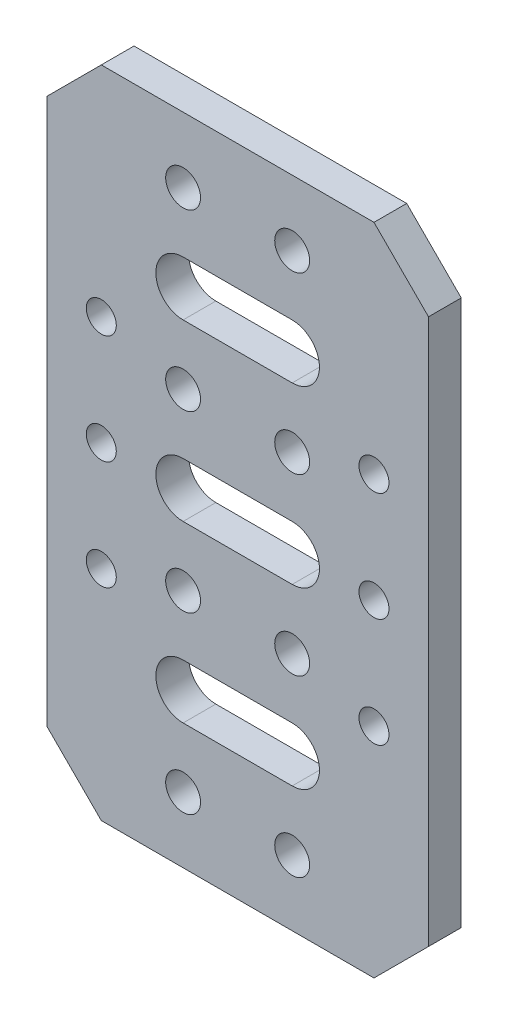
ISO-10303-21;
HEADER;
FILE_DESCRIPTION(('STEP AP214'),'2;1');
FILE_NAME('part.step','',(''),(''),'','','');
FILE_SCHEMA(('AUTOMOTIVE_DESIGN { 1 0 10303 214 1 1 1 1 }'));
ENDSEC;
DATA;
#1=APPLICATION_CONTEXT('core data for automotive mechanical design processes');
#2=APPLICATION_PROTOCOL_DEFINITION('international standard','automotive_design',2000,#1);
#3=PRODUCT_CONTEXT('',#1,'mechanical');
#4=PRODUCT('Part','Part','',(#3));
#5=PRODUCT_RELATED_PRODUCT_CATEGORY('part','',(#4));
#6=PRODUCT_DEFINITION_FORMATION('','',#4);
#7=PRODUCT_DEFINITION_CONTEXT('part definition',#1,'design');
#8=PRODUCT_DEFINITION('design','',#6,#7);
#9=PRODUCT_DEFINITION_SHAPE('','',#8);
#10=(LENGTH_UNIT() NAMED_UNIT(*) SI_UNIT(.MILLI.,.METRE.));
#11=(NAMED_UNIT(*) PLANE_ANGLE_UNIT() SI_UNIT($,.RADIAN.));
#12=(NAMED_UNIT(*) SI_UNIT($,.STERADIAN.) SOLID_ANGLE_UNIT());
#13=UNCERTAINTY_MEASURE_WITH_UNIT(LENGTH_MEASURE(1.E-05),#10,'distance_accuracy_value','');
#14=(GEOMETRIC_REPRESENTATION_CONTEXT(3) GLOBAL_UNCERTAINTY_ASSIGNED_CONTEXT((#13)) GLOBAL_UNIT_ASSIGNED_CONTEXT((#10,
#11,#12)) REPRESENTATION_CONTEXT('',''));
#15=CARTESIAN_POINT('',(0.,0.,0.));
#16=DIRECTION('',(0.,0.,1.));
#17=DIRECTION('',(1.,0.,0.));
#18=AXIS2_PLACEMENT_3D('',#15,#16,#17);
#19=CARTESIAN_POINT('',(0.,0.,3.));
#20=DIRECTION('',(0.,0.,1.));
#21=DIRECTION('',(1.,0.,0.));
#22=AXIS2_PLACEMENT_3D('',#19,#20,#21);
#23=PLANE('',#22);
#24=DIRECTION('',(1.,0.,0.));
#25=VECTOR('',#24,1.);
#26=CARTESIAN_POINT('',(0.,-18.5,3.));
#27=LINE('',#26,#25);
#28=CARTESIAN_POINT('',(-4.99999999999983,-18.5,3.));
#29=VERTEX_POINT('',#28);
#30=CARTESIAN_POINT('',(5.00000000000017,-18.5,3.));
#31=VERTEX_POINT('',#30);
#32=EDGE_CURVE('E54',#29,#31,#27,.T.);
#33=ORIENTED_EDGE('',*,*,#32,.F.);
#34=CARTESIAN_POINT('',(-4.99999999999983,-16.,3.));
#35=DIRECTION('',(0.,0.,1.));
#36=DIRECTION('',(1.,0.,0.));
#37=AXIS2_PLACEMENT_3D('',#34,#35,#36);
#38=CIRCLE('',#37,2.5);
#39=CARTESIAN_POINT('',(-4.99999999999983,-13.5,3.));
#40=VERTEX_POINT('',#39);
#41=EDGE_CURVE('E185',#40,#29,#38,.T.);
#42=ORIENTED_EDGE('',*,*,#41,.F.);
#43=DIRECTION('',(1.,0.,0.));
#44=VECTOR('',#43,1.);
#45=CARTESIAN_POINT('',(0.,-13.5,3.));
#46=LINE('',#45,#44);
#47=CARTESIAN_POINT('',(5.00000000000017,-13.5,3.));
#48=VERTEX_POINT('',#47);
#49=EDGE_CURVE('E212',#40,#48,#46,.T.);
#50=ORIENTED_EDGE('',*,*,#49,.T.);
#51=CARTESIAN_POINT('',(5.00000000000017,-16.,3.));
#52=DIRECTION('',(0.,0.,1.));
#53=DIRECTION('',(1.,0.,0.));
#54=AXIS2_PLACEMENT_3D('',#51,#52,#53);
#55=CIRCLE('',#54,2.5);
#56=EDGE_CURVE('E204',#31,#48,#55,.T.);
#57=ORIENTED_EDGE('',*,*,#56,.F.);
#58=EDGE_LOOP('',(#33,#42,#50,#57));
#59=FACE_BOUND('',#58,.T.);
#60=DIRECTION('',(1.,0.,0.));
#61=VECTOR('',#60,1.);
#62=CARTESIAN_POINT('',(0.,13.5,3.));
#63=LINE('',#62,#61);
#64=CARTESIAN_POINT('',(-5.00000000000006,13.5,3.));
#65=VERTEX_POINT('',#64);
#66=CARTESIAN_POINT('',(4.99999999999995,13.5,3.));
#67=VERTEX_POINT('',#66);
#68=EDGE_CURVE('E236',#65,#67,#63,.T.);
#69=ORIENTED_EDGE('',*,*,#68,.F.);
#70=CARTESIAN_POINT('',(-5.00000000000006,16.,3.));
#71=DIRECTION('',(0.,0.,1.));
#72=DIRECTION('',(1.,0.,0.));
#73=AXIS2_PLACEMENT_3D('',#70,#71,#72);
#74=CIRCLE('',#73,2.5);
#75=CARTESIAN_POINT('',(-5.00000000000006,18.5,3.));
#76=VERTEX_POINT('',#75);
#77=EDGE_CURVE('E247',#76,#65,#74,.T.);
#78=ORIENTED_EDGE('',*,*,#77,.F.);
#79=DIRECTION('',(1.,0.,0.));
#80=VECTOR('',#79,1.);
#81=CARTESIAN_POINT('',(0.,18.5,3.));
#82=LINE('',#81,#80);
#83=CARTESIAN_POINT('',(4.99999999999994,18.5,3.));
#84=VERTEX_POINT('',#83);
#85=EDGE_CURVE('E243',#76,#84,#82,.T.);
#86=ORIENTED_EDGE('',*,*,#85,.T.);
#87=CARTESIAN_POINT('',(4.99999999999994,16.,3.));
#88=DIRECTION('',(0.,0.,1.));
#89=DIRECTION('',(1.,0.,0.));
#90=AXIS2_PLACEMENT_3D('',#87,#88,#89);
#91=CIRCLE('',#90,2.5);
#92=EDGE_CURVE('E239',#67,#84,#91,.T.);
#93=ORIENTED_EDGE('',*,*,#92,.F.);
#94=EDGE_LOOP('',(#69,#78,#86,#93));
#95=FACE_BOUND('',#94,.T.);
#96=DIRECTION('',(1.,0.,0.));
#97=VECTOR('',#96,1.);
#98=CARTESIAN_POINT('',(0.,-2.5,3.));
#99=LINE('',#98,#97);
#100=CARTESIAN_POINT('',(-5.,-2.5,3.));
#101=VERTEX_POINT('',#100);
#102=CARTESIAN_POINT('',(5.,-2.5,3.));
#103=VERTEX_POINT('',#102);
#104=EDGE_CURVE('E280',#101,#103,#99,.T.);
#105=ORIENTED_EDGE('',*,*,#104,.F.);
#106=CARTESIAN_POINT('',(-5.,0.,3.));
#107=DIRECTION('',(0.,0.,1.));
#108=DIRECTION('',(1.,0.,0.));
#109=AXIS2_PLACEMENT_3D('',#106,#107,#108);
#110=CIRCLE('',#109,2.5);
#111=CARTESIAN_POINT('',(-5.,2.5,3.));
#112=VERTEX_POINT('',#111);
#113=EDGE_CURVE('E291',#112,#101,#110,.T.);
#114=ORIENTED_EDGE('',*,*,#113,.F.);
#115=DIRECTION('',(1.,0.,0.));
#116=VECTOR('',#115,1.);
#117=CARTESIAN_POINT('',(0.,2.5,3.));
#118=LINE('',#117,#116);
#119=CARTESIAN_POINT('',(5.,2.5,3.));
#120=VERTEX_POINT('',#119);
#121=EDGE_CURVE('E287',#112,#120,#118,.T.);
#122=ORIENTED_EDGE('',*,*,#121,.T.);
#123=CARTESIAN_POINT('',(5.,0.,3.));
#124=DIRECTION('',(0.,0.,1.));
#125=DIRECTION('',(1.,0.,0.));
#126=AXIS2_PLACEMENT_3D('',#123,#124,#125);
#127=CIRCLE('',#126,2.5);
#128=EDGE_CURVE('E283',#103,#120,#127,.T.);
#129=ORIENTED_EDGE('',*,*,#128,.F.);
#130=EDGE_LOOP('',(#105,#114,#122,#129));
#131=FACE_BOUND('',#130,.T.);
#132=CARTESIAN_POINT('',(-12.4999999999999,-10.,3.));
#133=DIRECTION('',(0.,0.,1.));
#134=DIRECTION('',(-1.,0.,0.));
#135=AXIS2_PLACEMENT_3D('',#132,#133,#134);
#136=CIRCLE('',#135,1.375);
#137=CARTESIAN_POINT('',(-13.8749999999999,-10.,3.));
#138=VERTEX_POINT('',#137);
#139=EDGE_CURVE('E312',#138,#138,#136,.T.);
#140=ORIENTED_EDGE('',*,*,#139,.F.);
#141=EDGE_LOOP('',(#140));
#142=FACE_BOUND('',#141,.T.);
#143=CARTESIAN_POINT('',(12.5000000000001,-10.,3.));
#144=DIRECTION('',(0.,0.,1.));
#145=DIRECTION('',(1.,0.,0.));
#146=AXIS2_PLACEMENT_3D('',#143,#144,#145);
#147=CIRCLE('',#146,1.375);
#148=CARTESIAN_POINT('',(13.8750000000001,-10.,3.));
#149=VERTEX_POINT('',#148);
#150=EDGE_CURVE('E320',#149,#149,#147,.T.);
#151=ORIENTED_EDGE('',*,*,#150,.F.);
#152=EDGE_LOOP('',(#151));
#153=FACE_BOUND('',#152,.T.);
#154=CARTESIAN_POINT('',(-12.5,10.,3.));
#155=DIRECTION('',(0.,0.,1.));
#156=DIRECTION('',(-1.,0.,0.));
#157=AXIS2_PLACEMENT_3D('',#154,#155,#156);
#158=CIRCLE('',#157,1.375);
#159=CARTESIAN_POINT('',(-13.875,10.,3.));
#160=VERTEX_POINT('',#159);
#161=EDGE_CURVE('E328',#160,#160,#158,.T.);
#162=ORIENTED_EDGE('',*,*,#161,.F.);
#163=EDGE_LOOP('',(#162));
#164=FACE_BOUND('',#163,.T.);
#165=CARTESIAN_POINT('',(12.5,10.,3.));
#166=DIRECTION('',(0.,0.,1.));
#167=DIRECTION('',(1.,0.,0.));
#168=AXIS2_PLACEMENT_3D('',#165,#166,#167);
#169=CIRCLE('',#168,1.375);
#170=CARTESIAN_POINT('',(13.875,10.,3.));
#171=VERTEX_POINT('',#170);
#172=EDGE_CURVE('E336',#171,#171,#169,.T.);
#173=ORIENTED_EDGE('',*,*,#172,.F.);
#174=EDGE_LOOP('',(#173));
#175=FACE_BOUND('',#174,.T.);
#176=CARTESIAN_POINT('',(-12.5,0.,3.));
#177=DIRECTION('',(0.,0.,1.));
#178=DIRECTION('',(-1.,0.,0.));
#179=AXIS2_PLACEMENT_3D('',#176,#177,#178);
#180=CIRCLE('',#179,1.375);
#181=CARTESIAN_POINT('',(-13.875,0.,3.));
#182=VERTEX_POINT('',#181);
#183=EDGE_CURVE('E344',#182,#182,#180,.T.);
#184=ORIENTED_EDGE('',*,*,#183,.F.);
#185=EDGE_LOOP('',(#184));
#186=FACE_BOUND('',#185,.T.);
#187=CARTESIAN_POINT('',(12.5,0.,3.));
#188=DIRECTION('',(0.,0.,1.));
#189=DIRECTION('',(1.,0.,0.));
#190=AXIS2_PLACEMENT_3D('',#187,#188,#189);
#191=CIRCLE('',#190,1.375);
#192=CARTESIAN_POINT('',(13.875,0.,3.));
#193=VERTEX_POINT('',#192);
#194=EDGE_CURVE('E352',#193,#193,#191,.T.);
#195=ORIENTED_EDGE('',*,*,#194,.F.);
#196=EDGE_LOOP('',(#195));
#197=FACE_BOUND('',#196,.T.);
#198=CARTESIAN_POINT('',(-4.99999999999966,-24.,3.));
#199=DIRECTION('',(0.,0.,1.));
#200=DIRECTION('',(1.,0.,0.));
#201=AXIS2_PLACEMENT_3D('',#198,#199,#200);
#202=CIRCLE('',#201,1.6);
#203=CARTESIAN_POINT('',(-3.39999999999965,-24.,3.));
#204=VERTEX_POINT('',#203);
#205=EDGE_CURVE('E369',#204,#204,#202,.T.);
#206=ORIENTED_EDGE('',*,*,#205,.F.);
#207=EDGE_LOOP('',(#206));
#208=FACE_BOUND('',#207,.T.);
#209=CARTESIAN_POINT('',(-4.99999999999982,-8.00000000000001,3.));
#210=DIRECTION('',(0.,0.,1.));
#211=DIRECTION('',(1.,0.,0.));
#212=AXIS2_PLACEMENT_3D('',#209,#210,#211);
#213=CIRCLE('',#212,1.6);
#214=CARTESIAN_POINT('',(-3.39999999999982,-8.00000000000001,3.));
#215=VERTEX_POINT('',#214);
#216=EDGE_CURVE('E385',#215,#215,#213,.T.);
#217=ORIENTED_EDGE('',*,*,#216,.F.);
#218=EDGE_LOOP('',(#217));
#219=FACE_BOUND('',#218,.T.);
#220=CARTESIAN_POINT('',(-5.00000000000005,24.,3.));
#221=DIRECTION('',(0.,0.,1.));
#222=DIRECTION('',(1.,0.,0.));
#223=AXIS2_PLACEMENT_3D('',#220,#221,#222);
#224=CIRCLE('',#223,1.6);
#225=CARTESIAN_POINT('',(-3.40000000000005,24.,3.));
#226=VERTEX_POINT('',#225);
#227=EDGE_CURVE('E401',#226,#226,#224,.T.);
#228=ORIENTED_EDGE('',*,*,#227,.F.);
#229=EDGE_LOOP('',(#228));
#230=FACE_BOUND('',#229,.T.);
#231=CARTESIAN_POINT('',(-5.,8.,3.));
#232=DIRECTION('',(0.,0.,1.));
#233=DIRECTION('',(1.,0.,0.));
#234=AXIS2_PLACEMENT_3D('',#231,#232,#233);
#235=CIRCLE('',#234,1.6);
#236=CARTESIAN_POINT('',(-3.39999999999999,8.,3.));
#237=VERTEX_POINT('',#236);
#238=EDGE_CURVE('E417',#237,#237,#235,.T.);
#239=ORIENTED_EDGE('',*,*,#238,.F.);
#240=EDGE_LOOP('',(#239));
#241=FACE_BOUND('',#240,.T.);
#242=DIRECTION('',(1.,0.,0.));
#243=VECTOR('',#242,1.);
#244=CARTESIAN_POINT('',(-17.5,-30.,3.));
#245=LINE('',#244,#243);
#246=CARTESIAN_POINT('',(-12.5,-30.,3.));
#247=VERTEX_POINT('',#246);
#248=CARTESIAN_POINT('',(12.5,-30.,3.));
#249=VERTEX_POINT('',#248);
#250=EDGE_CURVE('E438',#247,#249,#245,.T.);
#251=ORIENTED_EDGE('',*,*,#250,.T.);
#252=DIRECTION('',(-0.707106781186549,-0.707106781186546,0.));
#253=VECTOR('',#252,1.);
#254=CARTESIAN_POINT('',(21.25,-21.25,3.));
#255=LINE('',#254,#253);
#256=CARTESIAN_POINT('',(17.5,-25.,3.));
#257=VERTEX_POINT('',#256);
#258=EDGE_CURVE('E490',#249,#257,#255,.F.);
#259=ORIENTED_EDGE('',*,*,#258,.T.);
#260=DIRECTION('',(0.,1.,0.));
#261=VECTOR('',#260,1.);
#262=CARTESIAN_POINT('',(17.5,30.,3.));
#263=LINE('',#262,#261);
#264=CARTESIAN_POINT('',(17.5,25.,3.));
#265=VERTEX_POINT('',#264);
#266=EDGE_CURVE('E425',#257,#265,#263,.T.);
#267=ORIENTED_EDGE('',*,*,#266,.T.);
#268=DIRECTION('',(0.707106781186546,-0.707106781186549,0.));
#269=VECTOR('',#268,1.);
#270=CARTESIAN_POINT('',(21.25,21.2499999999999,3.));
#271=LINE('',#270,#269);
#272=CARTESIAN_POINT('',(12.5,30.,3.));
#273=VERTEX_POINT('',#272);
#274=EDGE_CURVE('E485',#265,#273,#271,.F.);
#275=ORIENTED_EDGE('',*,*,#274,.T.);
#276=DIRECTION('',(-1.,0.,0.));
#277=VECTOR('',#276,1.);
#278=CARTESIAN_POINT('',(-17.5,30.,3.));
#279=LINE('',#278,#277);
#280=CARTESIAN_POINT('',(-12.5,30.,3.));
#281=VERTEX_POINT('',#280);
#282=EDGE_CURVE('E429',#273,#281,#279,.T.);
#283=ORIENTED_EDGE('',*,*,#282,.T.);
#284=DIRECTION('',(0.707106781186549,0.707106781186547,0.));
#285=VECTOR('',#284,1.);
#286=CARTESIAN_POINT('',(-21.25,21.25,3.));
#287=LINE('',#286,#285);
#288=CARTESIAN_POINT('',(-17.5,25.,3.));
#289=VERTEX_POINT('',#288);
#290=EDGE_CURVE('E482',#281,#289,#287,.F.);
#291=ORIENTED_EDGE('',*,*,#290,.T.);
#292=DIRECTION('',(0.,-1.,0.));
#293=VECTOR('',#292,1.);
#294=CARTESIAN_POINT('',(-17.5,30.,3.));
#295=LINE('',#294,#293);
#296=CARTESIAN_POINT('',(-17.5,-25.,3.));
#297=VERTEX_POINT('',#296);
#298=EDGE_CURVE('E434',#289,#297,#295,.T.);
#299=ORIENTED_EDGE('',*,*,#298,.T.);
#300=DIRECTION('',(-0.707106781186546,0.707106781186549,0.));
#301=VECTOR('',#300,1.);
#302=CARTESIAN_POINT('',(-21.25,-21.2499999999999,3.));
#303=LINE('',#302,#301);
#304=EDGE_CURVE('E488',#297,#247,#303,.F.);
#305=ORIENTED_EDGE('',*,*,#304,.T.);
#306=EDGE_LOOP('',(#251,#259,#267,#275,#283,#291,#299,#305));
#307=FACE_BOUND('',#306,.T.);
#308=CARTESIAN_POINT('',(5.00000000000001,7.99999999999999,3.));
#309=DIRECTION('',(0.,0.,1.));
#310=DIRECTION('',(-1.,0.,0.));
#311=AXIS2_PLACEMENT_3D('',#308,#309,#310);
#312=CIRCLE('',#311,1.6);
#313=CARTESIAN_POINT('',(3.40000000000001,7.99999999999999,3.));
#314=VERTEX_POINT('',#313);
#315=EDGE_CURVE('E409',#314,#314,#312,.T.);
#316=ORIENTED_EDGE('',*,*,#315,.F.);
#317=EDGE_LOOP('',(#316));
#318=FACE_BOUND('',#317,.T.);
#319=CARTESIAN_POINT('',(4.99999999999996,24.,3.));
#320=DIRECTION('',(0.,0.,1.));
#321=DIRECTION('',(-1.,0.,0.));
#322=AXIS2_PLACEMENT_3D('',#319,#320,#321);
#323=CIRCLE('',#322,1.6);
#324=CARTESIAN_POINT('',(3.39999999999996,24.,3.));
#325=VERTEX_POINT('',#324);
#326=EDGE_CURVE('E393',#325,#325,#323,.T.);
#327=ORIENTED_EDGE('',*,*,#326,.F.);
#328=EDGE_LOOP('',(#327));
#329=FACE_BOUND('',#328,.T.);
#330=CARTESIAN_POINT('',(5.00000000000018,-8.00000000000001,3.));
#331=DIRECTION('',(0.,0.,1.));
#332=DIRECTION('',(-1.,0.,0.));
#333=AXIS2_PLACEMENT_3D('',#330,#331,#332);
#334=CIRCLE('',#333,1.6);
#335=CARTESIAN_POINT('',(3.40000000000018,-8.00000000000001,3.));
#336=VERTEX_POINT('',#335);
#337=EDGE_CURVE('E377',#336,#336,#334,.T.);
#338=ORIENTED_EDGE('',*,*,#337,.F.);
#339=EDGE_LOOP('',(#338));
#340=FACE_BOUND('',#339,.T.);
#341=CARTESIAN_POINT('',(5.00000000000035,-24.,3.));
#342=DIRECTION('',(0.,0.,1.));
#343=DIRECTION('',(-1.,0.,0.));
#344=AXIS2_PLACEMENT_3D('',#341,#342,#343);
#345=CIRCLE('',#344,1.6);
#346=CARTESIAN_POINT('',(3.40000000000035,-24.,3.));
#347=VERTEX_POINT('',#346);
#348=EDGE_CURVE('E361',#347,#347,#345,.T.);
#349=ORIENTED_EDGE('',*,*,#348,.F.);
#350=EDGE_LOOP('',(#349));
#351=FACE_BOUND('',#350,.T.);
#352=ADVANCED_FACE('F38',(#59,#95,#131,#142,#153,#164,#175,#186,#197,#208,#219,#230,#241,#307,
#318,#329,#340,#351),#23,.T.);
#353=CARTESIAN_POINT('',(0.,0.,0.));
#354=DIRECTION('',(0.,0.,1.));
#355=DIRECTION('',(1.,0.,0.));
#356=AXIS2_PLACEMENT_3D('',#353,#354,#355);
#357=PLANE('',#356);
#358=CARTESIAN_POINT('',(-4.99999999999983,-16.,0.));
#359=DIRECTION('',(0.,0.,1.));
#360=DIRECTION('',(1.,0.,0.));
#361=AXIS2_PLACEMENT_3D('',#358,#359,#360);
#362=CIRCLE('',#361,2.5);
#363=CARTESIAN_POINT('',(-4.99999999999983,-18.5,0.));
#364=VERTEX_POINT('',#363);
#365=CARTESIAN_POINT('',(-4.99999999999983,-13.5,0.));
#366=VERTEX_POINT('',#365);
#367=EDGE_CURVE('E198',#364,#366,#362,.F.);
#368=ORIENTED_EDGE('',*,*,#367,.F.);
#369=DIRECTION('',(-1.,0.,0.));
#370=VECTOR('',#369,1.);
#371=CARTESIAN_POINT('',(0.,-18.5,0.));
#372=LINE('',#371,#370);
#373=CARTESIAN_POINT('',(5.00000000000017,-18.5,0.));
#374=VERTEX_POINT('',#373);
#375=EDGE_CURVE('E178',#374,#364,#372,.T.);
#376=ORIENTED_EDGE('',*,*,#375,.F.);
#377=CARTESIAN_POINT('',(5.00000000000017,-16.,0.));
#378=DIRECTION('',(0.,0.,1.));
#379=DIRECTION('',(1.,0.,0.));
#380=AXIS2_PLACEMENT_3D('',#377,#378,#379);
#381=CIRCLE('',#380,2.5);
#382=CARTESIAN_POINT('',(5.00000000000017,-13.5,0.));
#383=VERTEX_POINT('',#382);
#384=EDGE_CURVE('E188',#383,#374,#381,.F.);
#385=ORIENTED_EDGE('',*,*,#384,.F.);
#386=DIRECTION('',(-1.,0.,0.));
#387=VECTOR('',#386,1.);
#388=CARTESIAN_POINT('',(0.,-13.5,0.));
#389=LINE('',#388,#387);
#390=EDGE_CURVE('E62',#383,#366,#389,.T.);
#391=ORIENTED_EDGE('',*,*,#390,.T.);
#392=EDGE_LOOP('',(#368,#376,#385,#391));
#393=FACE_BOUND('',#392,.T.);
#394=CARTESIAN_POINT('',(-5.00000000000006,16.,0.));
#395=DIRECTION('',(0.,0.,1.));
#396=DIRECTION('',(1.,0.,0.));
#397=AXIS2_PLACEMENT_3D('',#394,#395,#396);
#398=CIRCLE('',#397,2.5);
#399=CARTESIAN_POINT('',(-5.00000000000006,13.5,0.));
#400=VERTEX_POINT('',#399);
#401=CARTESIAN_POINT('',(-5.00000000000006,18.5,0.));
#402=VERTEX_POINT('',#401);
#403=EDGE_CURVE('E228',#400,#402,#398,.F.);
#404=ORIENTED_EDGE('',*,*,#403,.F.);
#405=DIRECTION('',(-1.,0.,0.));
#406=VECTOR('',#405,1.);
#407=CARTESIAN_POINT('',(0.,13.5,0.));
#408=LINE('',#407,#406);
#409=CARTESIAN_POINT('',(4.99999999999995,13.5,0.));
#410=VERTEX_POINT('',#409);
#411=EDGE_CURVE('E232',#410,#400,#408,.T.);
#412=ORIENTED_EDGE('',*,*,#411,.F.);
#413=CARTESIAN_POINT('',(4.99999999999994,16.,0.));
#414=DIRECTION('',(0.,0.,1.));
#415=DIRECTION('',(1.,0.,0.));
#416=AXIS2_PLACEMENT_3D('',#413,#414,#415);
#417=CIRCLE('',#416,2.5);
#418=CARTESIAN_POINT('',(4.99999999999994,18.5,0.));
#419=VERTEX_POINT('',#418);
#420=EDGE_CURVE('E255',#419,#410,#417,.F.);
#421=ORIENTED_EDGE('',*,*,#420,.F.);
#422=DIRECTION('',(-1.,0.,0.));
#423=VECTOR('',#422,1.);
#424=CARTESIAN_POINT('',(0.,18.5,0.));
#425=LINE('',#424,#423);
#426=EDGE_CURVE('E192',#419,#402,#425,.T.);
#427=ORIENTED_EDGE('',*,*,#426,.T.);
#428=EDGE_LOOP('',(#404,#412,#421,#427));
#429=FACE_BOUND('',#428,.T.);
#430=CARTESIAN_POINT('',(-5.,0.,0.));
#431=DIRECTION('',(0.,0.,1.));
#432=DIRECTION('',(1.,0.,0.));
#433=AXIS2_PLACEMENT_3D('',#430,#431,#432);
#434=CIRCLE('',#433,2.5);
#435=CARTESIAN_POINT('',(-5.,-2.5,0.));
#436=VERTEX_POINT('',#435);
#437=CARTESIAN_POINT('',(-5.,2.5,0.));
#438=VERTEX_POINT('',#437);
#439=EDGE_CURVE('E272',#436,#438,#434,.F.);
#440=ORIENTED_EDGE('',*,*,#439,.F.);
#441=DIRECTION('',(-1.,0.,0.));
#442=VECTOR('',#441,1.);
#443=CARTESIAN_POINT('',(0.,-2.5,0.));
#444=LINE('',#443,#442);
#445=CARTESIAN_POINT('',(5.,-2.5,0.));
#446=VERTEX_POINT('',#445);
#447=EDGE_CURVE('E276',#446,#436,#444,.T.);
#448=ORIENTED_EDGE('',*,*,#447,.F.);
#449=CARTESIAN_POINT('',(5.,0.,0.));
#450=DIRECTION('',(0.,0.,1.));
#451=DIRECTION('',(1.,0.,0.));
#452=AXIS2_PLACEMENT_3D('',#449,#450,#451);
#453=CIRCLE('',#452,2.5);
#454=CARTESIAN_POINT('',(5.,2.5,0.));
#455=VERTEX_POINT('',#454);
#456=EDGE_CURVE('E299',#455,#446,#453,.F.);
#457=ORIENTED_EDGE('',*,*,#456,.F.);
#458=DIRECTION('',(-1.,0.,0.));
#459=VECTOR('',#458,1.);
#460=CARTESIAN_POINT('',(0.,2.5,0.));
#461=LINE('',#460,#459);
#462=EDGE_CURVE('E268',#455,#438,#461,.T.);
#463=ORIENTED_EDGE('',*,*,#462,.T.);
#464=EDGE_LOOP('',(#440,#448,#457,#463));
#465=FACE_BOUND('',#464,.T.);
#466=CARTESIAN_POINT('',(-12.4999999999999,-10.,0.));
#467=DIRECTION('',(0.,0.,1.));
#468=DIRECTION('',(1.,0.,0.));
#469=AXIS2_PLACEMENT_3D('',#466,#467,#468);
#470=CIRCLE('',#469,1.375);
#471=CARTESIAN_POINT('',(-11.1249999999999,-10.,0.));
#472=VERTEX_POINT('',#471);
#473=EDGE_CURVE('E316',#472,#472,#470,.F.);
#474=ORIENTED_EDGE('',*,*,#473,.F.);
#475=EDGE_LOOP('',(#474));
#476=FACE_BOUND('',#475,.T.);
#477=CARTESIAN_POINT('',(12.5000000000001,-10.,0.));
#478=DIRECTION('',(0.,0.,1.));
#479=DIRECTION('',(1.,0.,0.));
#480=AXIS2_PLACEMENT_3D('',#477,#478,#479);
#481=CIRCLE('',#480,1.375);
#482=CARTESIAN_POINT('',(13.8750000000001,-10.,0.));
#483=VERTEX_POINT('',#482);
#484=EDGE_CURVE('E324',#483,#483,#481,.F.);
#485=ORIENTED_EDGE('',*,*,#484,.F.);
#486=EDGE_LOOP('',(#485));
#487=FACE_BOUND('',#486,.T.);
#488=CARTESIAN_POINT('',(-12.5,10.,0.));
#489=DIRECTION('',(0.,0.,1.));
#490=DIRECTION('',(1.,0.,0.));
#491=AXIS2_PLACEMENT_3D('',#488,#489,#490);
#492=CIRCLE('',#491,1.375);
#493=CARTESIAN_POINT('',(-11.125,10.,0.));
#494=VERTEX_POINT('',#493);
#495=EDGE_CURVE('E332',#494,#494,#492,.F.);
#496=ORIENTED_EDGE('',*,*,#495,.F.);
#497=EDGE_LOOP('',(#496));
#498=FACE_BOUND('',#497,.T.);
#499=CARTESIAN_POINT('',(12.5,10.,0.));
#500=DIRECTION('',(0.,0.,1.));
#501=DIRECTION('',(1.,0.,0.));
#502=AXIS2_PLACEMENT_3D('',#499,#500,#501);
#503=CIRCLE('',#502,1.375);
#504=CARTESIAN_POINT('',(13.875,10.,0.));
#505=VERTEX_POINT('',#504);
#506=EDGE_CURVE('E340',#505,#505,#503,.F.);
#507=ORIENTED_EDGE('',*,*,#506,.F.);
#508=EDGE_LOOP('',(#507));
#509=FACE_BOUND('',#508,.T.);
#510=CARTESIAN_POINT('',(-12.5,0.,0.));
#511=DIRECTION('',(0.,0.,1.));
#512=DIRECTION('',(1.,0.,0.));
#513=AXIS2_PLACEMENT_3D('',#510,#511,#512);
#514=CIRCLE('',#513,1.375);
#515=CARTESIAN_POINT('',(-11.125,0.,0.));
#516=VERTEX_POINT('',#515);
#517=EDGE_CURVE('E348',#516,#516,#514,.F.);
#518=ORIENTED_EDGE('',*,*,#517,.F.);
#519=EDGE_LOOP('',(#518));
#520=FACE_BOUND('',#519,.T.);
#521=CARTESIAN_POINT('',(12.5,0.,0.));
#522=DIRECTION('',(0.,0.,1.));
#523=DIRECTION('',(1.,0.,0.));
#524=AXIS2_PLACEMENT_3D('',#521,#522,#523);
#525=CIRCLE('',#524,1.375);
#526=CARTESIAN_POINT('',(13.875,0.,0.));
#527=VERTEX_POINT('',#526);
#528=EDGE_CURVE('E356',#527,#527,#525,.F.);
#529=ORIENTED_EDGE('',*,*,#528,.F.);
#530=EDGE_LOOP('',(#529));
#531=FACE_BOUND('',#530,.T.);
#532=CARTESIAN_POINT('',(-4.99999999999966,-24.,0.));
#533=DIRECTION('',(0.,0.,1.));
#534=DIRECTION('',(1.,0.,0.));
#535=AXIS2_PLACEMENT_3D('',#532,#533,#534);
#536=CIRCLE('',#535,1.6);
#537=CARTESIAN_POINT('',(-3.39999999999965,-24.,0.));
#538=VERTEX_POINT('',#537);
#539=EDGE_CURVE('E365',#538,#538,#536,.T.);
#540=ORIENTED_EDGE('',*,*,#539,.T.);
#541=EDGE_LOOP('',(#540));
#542=FACE_BOUND('',#541,.T.);
#543=CARTESIAN_POINT('',(-4.99999999999982,-8.00000000000001,0.));
#544=DIRECTION('',(0.,0.,1.));
#545=DIRECTION('',(1.,0.,0.));
#546=AXIS2_PLACEMENT_3D('',#543,#544,#545);
#547=CIRCLE('',#546,1.6);
#548=CARTESIAN_POINT('',(-3.39999999999982,-8.00000000000001,0.));
#549=VERTEX_POINT('',#548);
#550=EDGE_CURVE('E381',#549,#549,#547,.T.);
#551=ORIENTED_EDGE('',*,*,#550,.T.);
#552=EDGE_LOOP('',(#551));
#553=FACE_BOUND('',#552,.T.);
#554=CARTESIAN_POINT('',(-5.00000000000005,24.,0.));
#555=DIRECTION('',(0.,0.,1.));
#556=DIRECTION('',(1.,0.,0.));
#557=AXIS2_PLACEMENT_3D('',#554,#555,#556);
#558=CIRCLE('',#557,1.6);
#559=CARTESIAN_POINT('',(-3.40000000000005,24.,0.));
#560=VERTEX_POINT('',#559);
#561=EDGE_CURVE('E397',#560,#560,#558,.T.);
#562=ORIENTED_EDGE('',*,*,#561,.T.);
#563=EDGE_LOOP('',(#562));
#564=FACE_BOUND('',#563,.T.);
#565=CARTESIAN_POINT('',(-5.,8.,0.));
#566=DIRECTION('',(0.,0.,1.));
#567=DIRECTION('',(1.,0.,0.));
#568=AXIS2_PLACEMENT_3D('',#565,#566,#567);
#569=CIRCLE('',#568,1.6);
#570=CARTESIAN_POINT('',(-3.39999999999999,8.,0.));
#571=VERTEX_POINT('',#570);
#572=EDGE_CURVE('E413',#571,#571,#569,.T.);
#573=ORIENTED_EDGE('',*,*,#572,.T.);
#574=EDGE_LOOP('',(#573));
#575=FACE_BOUND('',#574,.T.);
#576=DIRECTION('',(0.,1.,0.));
#577=VECTOR('',#576,1.);
#578=CARTESIAN_POINT('',(17.5,30.,0.));
#579=LINE('',#578,#577);
#580=CARTESIAN_POINT('',(17.5,-25.,0.));
#581=VERTEX_POINT('',#580);
#582=CARTESIAN_POINT('',(17.5,25.,0.));
#583=VERTEX_POINT('',#582);
#584=EDGE_CURVE('E421',#581,#583,#579,.T.);
#585=ORIENTED_EDGE('',*,*,#584,.F.);
#586=DIRECTION('',(0.707106781186549,0.707106781186546,0.));
#587=VECTOR('',#586,1.);
#588=CARTESIAN_POINT('',(17.5,-25.,0.));
#589=LINE('',#588,#587);
#590=CARTESIAN_POINT('',(12.5,-30.,0.));
#591=VERTEX_POINT('',#590);
#592=EDGE_CURVE('E472',#581,#591,#589,.F.);
#593=ORIENTED_EDGE('',*,*,#592,.T.);
#594=DIRECTION('',(1.,0.,0.));
#595=VECTOR('',#594,1.);
#596=CARTESIAN_POINT('',(-17.5,-30.,0.));
#597=LINE('',#596,#595);
#598=CARTESIAN_POINT('',(-12.5,-30.,0.));
#599=VERTEX_POINT('',#598);
#600=EDGE_CURVE('E430',#599,#591,#597,.T.);
#601=ORIENTED_EDGE('',*,*,#600,.F.);
#602=DIRECTION('',(0.707106781186546,-0.707106781186549,0.));
#603=VECTOR('',#602,1.);
#604=CARTESIAN_POINT('',(-12.5,-30.,0.));
#605=LINE('',#604,#603);
#606=CARTESIAN_POINT('',(-17.5,-25.,0.));
#607=VERTEX_POINT('',#606);
#608=EDGE_CURVE('E469',#599,#607,#605,.F.);
#609=ORIENTED_EDGE('',*,*,#608,.T.);
#610=DIRECTION('',(0.,-1.,0.));
#611=VECTOR('',#610,1.);
#612=CARTESIAN_POINT('',(-17.5,30.,0.));
#613=LINE('',#612,#611);
#614=CARTESIAN_POINT('',(-17.5,25.,0.));
#615=VERTEX_POINT('',#614);
#616=EDGE_CURVE('E450',#615,#607,#613,.T.);
#617=ORIENTED_EDGE('',*,*,#616,.F.);
#618=DIRECTION('',(-0.707106781186549,-0.707106781186547,0.));
#619=VECTOR('',#618,1.);
#620=CARTESIAN_POINT('',(-17.5,25.,0.));
#621=LINE('',#620,#619);
#622=CARTESIAN_POINT('',(-12.5,30.,0.));
#623=VERTEX_POINT('',#622);
#624=EDGE_CURVE('E463',#615,#623,#621,.F.);
#625=ORIENTED_EDGE('',*,*,#624,.T.);
#626=DIRECTION('',(-1.,0.,0.));
#627=VECTOR('',#626,1.);
#628=CARTESIAN_POINT('',(-17.5,30.,0.));
#629=LINE('',#628,#627);
#630=CARTESIAN_POINT('',(12.5,30.,0.));
#631=VERTEX_POINT('',#630);
#632=EDGE_CURVE('E446',#631,#623,#629,.T.);
#633=ORIENTED_EDGE('',*,*,#632,.F.);
#634=DIRECTION('',(-0.707106781186546,0.707106781186549,0.));
#635=VECTOR('',#634,1.);
#636=CARTESIAN_POINT('',(12.5,30.,0.));
#637=LINE('',#636,#635);
#638=EDGE_CURVE('E466',#631,#583,#637,.F.);
#639=ORIENTED_EDGE('',*,*,#638,.T.);
#640=EDGE_LOOP('',(#585,#593,#601,#609,#617,#625,#633,#639));
#641=FACE_BOUND('',#640,.T.);
#642=CARTESIAN_POINT('',(5.00000000000001,7.99999999999999,0.));
#643=DIRECTION('',(0.,0.,1.));
#644=DIRECTION('',(-1.,0.,0.));
#645=AXIS2_PLACEMENT_3D('',#642,#643,#644);
#646=CIRCLE('',#645,1.6);
#647=CARTESIAN_POINT('',(3.40000000000001,7.99999999999999,0.));
#648=VERTEX_POINT('',#647);
#649=EDGE_CURVE('E405',#648,#648,#646,.T.);
#650=ORIENTED_EDGE('',*,*,#649,.T.);
#651=EDGE_LOOP('',(#650));
#652=FACE_BOUND('',#651,.T.);
#653=CARTESIAN_POINT('',(4.99999999999996,24.,0.));
#654=DIRECTION('',(0.,0.,1.));
#655=DIRECTION('',(-1.,0.,0.));
#656=AXIS2_PLACEMENT_3D('',#653,#654,#655);
#657=CIRCLE('',#656,1.6);
#658=CARTESIAN_POINT('',(3.39999999999996,24.,0.));
#659=VERTEX_POINT('',#658);
#660=EDGE_CURVE('E389',#659,#659,#657,.T.);
#661=ORIENTED_EDGE('',*,*,#660,.T.);
#662=EDGE_LOOP('',(#661));
#663=FACE_BOUND('',#662,.T.);
#664=CARTESIAN_POINT('',(5.00000000000018,-8.00000000000001,0.));
#665=DIRECTION('',(0.,0.,1.));
#666=DIRECTION('',(-1.,0.,0.));
#667=AXIS2_PLACEMENT_3D('',#664,#665,#666);
#668=CIRCLE('',#667,1.6);
#669=CARTESIAN_POINT('',(3.40000000000018,-8.00000000000001,0.));
#670=VERTEX_POINT('',#669);
#671=EDGE_CURVE('E373',#670,#670,#668,.T.);
#672=ORIENTED_EDGE('',*,*,#671,.T.);
#673=EDGE_LOOP('',(#672));
#674=FACE_BOUND('',#673,.T.);
#675=CARTESIAN_POINT('',(5.00000000000035,-24.,0.));
#676=DIRECTION('',(0.,0.,1.));
#677=DIRECTION('',(-1.,0.,0.));
#678=AXIS2_PLACEMENT_3D('',#675,#676,#677);
#679=CIRCLE('',#678,1.6);
#680=CARTESIAN_POINT('',(3.40000000000035,-24.,0.));
#681=VERTEX_POINT('',#680);
#682=EDGE_CURVE('E360',#681,#681,#679,.T.);
#683=ORIENTED_EDGE('',*,*,#682,.T.);
#684=EDGE_LOOP('',(#683));
#685=FACE_BOUND('',#684,.T.);
#686=ADVANCED_FACE('F195',(#393,#429,#465,#476,#487,#498,#509,#520,#531,#542,#553,#564,#575,
#641,#652,#663,#674,#685),#357,.F.);
#687=CARTESIAN_POINT('',(17.5,30.,3.));
#688=DIRECTION('',(-1.,0.,0.));
#689=DIRECTION('',(0.,-1.,0.));
#690=AXIS2_PLACEMENT_3D('',#687,#688,#689);
#691=PLANE('',#690);
#692=ORIENTED_EDGE('',*,*,#266,.F.);
#693=DIRECTION('',(0.,0.,-1.));
#694=VECTOR('',#693,1.);
#695=CARTESIAN_POINT('',(17.5,-25.,3.));
#696=LINE('',#695,#694);
#697=EDGE_CURVE('E459',#257,#581,#696,.T.);
#698=ORIENTED_EDGE('',*,*,#697,.T.);
#699=ORIENTED_EDGE('',*,*,#584,.T.);
#700=DIRECTION('',(0.,0.,1.));
#701=VECTOR('',#700,1.);
#702=CARTESIAN_POINT('',(17.5,25.,3.));
#703=LINE('',#702,#701);
#704=EDGE_CURVE('E442',#583,#265,#703,.T.);
#705=ORIENTED_EDGE('',*,*,#704,.T.);
#706=EDGE_LOOP('',(#692,#698,#699,#705));
#707=FACE_BOUND('',#706,.T.);
#708=ADVANCED_FACE('F535',(#707),#691,.F.);
#709=CARTESIAN_POINT('',(-17.5,30.,3.));
#710=DIRECTION('',(0.,-1.,0.));
#711=DIRECTION('',(0.,0.,-1.));
#712=AXIS2_PLACEMENT_3D('',#709,#710,#711);
#713=PLANE('',#712);
#714=ORIENTED_EDGE('',*,*,#282,.F.);
#715=DIRECTION('',(0.,0.,-1.));
#716=VECTOR('',#715,1.);
#717=CARTESIAN_POINT('',(12.5,30.,3.));
#718=LINE('',#717,#716);
#719=EDGE_CURVE('E11',#273,#631,#718,.T.);
#720=ORIENTED_EDGE('',*,*,#719,.T.);
#721=ORIENTED_EDGE('',*,*,#632,.T.);
#722=DIRECTION('',(0.,0.,1.));
#723=VECTOR('',#722,1.);
#724=CARTESIAN_POINT('',(-12.5,30.,3.));
#725=LINE('',#724,#723);
#726=EDGE_CURVE('E47',#623,#281,#725,.T.);
#727=ORIENTED_EDGE('',*,*,#726,.T.);
#728=EDGE_LOOP('',(#714,#720,#721,#727));
#729=FACE_BOUND('',#728,.T.);
#730=ADVANCED_FACE('F503',(#729),#713,.F.);
#731=CARTESIAN_POINT('',(-17.5,30.,3.));
#732=DIRECTION('',(1.,0.,0.));
#733=DIRECTION('',(0.,1.,0.));
#734=AXIS2_PLACEMENT_3D('',#731,#732,#733);
#735=PLANE('',#734);
#736=ORIENTED_EDGE('',*,*,#616,.T.);
#737=DIRECTION('',(0.,0.,1.));
#738=VECTOR('',#737,1.);
#739=CARTESIAN_POINT('',(-17.5,-25.,3.));
#740=LINE('',#739,#738);
#741=EDGE_CURVE('E497',#607,#297,#740,.T.);
#742=ORIENTED_EDGE('',*,*,#741,.T.);
#743=ORIENTED_EDGE('',*,*,#298,.F.);
#744=DIRECTION('',(0.,0.,-1.));
#745=VECTOR('',#744,1.);
#746=CARTESIAN_POINT('',(-17.5,25.,3.));
#747=LINE('',#746,#745);
#748=EDGE_CURVE('E493',#289,#615,#747,.T.);
#749=ORIENTED_EDGE('',*,*,#748,.T.);
#750=EDGE_LOOP('',(#736,#742,#743,#749));
#751=FACE_BOUND('',#750,.T.);
#752=ADVANCED_FACE('F515',(#751),#735,.F.);
#753=CARTESIAN_POINT('',(-17.5,-30.,3.));
#754=DIRECTION('',(0.,1.,0.));
#755=DIRECTION('',(0.,0.,1.));
#756=AXIS2_PLACEMENT_3D('',#753,#754,#755);
#757=PLANE('',#756);
#758=ORIENTED_EDGE('',*,*,#600,.T.);
#759=DIRECTION('',(0.,0.,1.));
#760=VECTOR('',#759,1.);
#761=CARTESIAN_POINT('',(12.5,-30.,3.));
#762=LINE('',#761,#760);
#763=EDGE_CURVE('E479',#591,#249,#762,.T.);
#764=ORIENTED_EDGE('',*,*,#763,.T.);
#765=ORIENTED_EDGE('',*,*,#250,.F.);
#766=DIRECTION('',(0.,0.,-1.));
#767=VECTOR('',#766,1.);
#768=CARTESIAN_POINT('',(-12.5,-30.,3.));
#769=LINE('',#768,#767);
#770=EDGE_CURVE('E475',#247,#599,#769,.T.);
#771=ORIENTED_EDGE('',*,*,#770,.T.);
#772=EDGE_LOOP('',(#758,#764,#765,#771));
#773=FACE_BOUND('',#772,.T.);
#774=ADVANCED_FACE('F527',(#773),#757,.F.);
#775=CARTESIAN_POINT('',(-5.,8.,3.));
#776=DIRECTION('',(0.,0.,-1.));
#777=DIRECTION('',(-1.,0.,0.));
#778=AXIS2_PLACEMENT_3D('',#775,#776,#777);
#779=CYLINDRICAL_SURFACE('',#778,1.6);
#780=ORIENTED_EDGE('',*,*,#238,.T.);
#781=EDGE_LOOP('',(#780));
#782=FACE_BOUND('',#781,.T.);
#783=ORIENTED_EDGE('',*,*,#572,.F.);
#784=EDGE_LOOP('',(#783));
#785=FACE_BOUND('',#784,.T.);
#786=ADVANCED_FACE('F555',(#782,#785),#779,.F.);
#787=CARTESIAN_POINT('',(5.00000000000001,7.99999999999999,3.));
#788=DIRECTION('',(0.,0.,-1.));
#789=DIRECTION('',(-1.,0.,0.));
#790=AXIS2_PLACEMENT_3D('',#787,#788,#789);
#791=CYLINDRICAL_SURFACE('',#790,1.6);
#792=ORIENTED_EDGE('',*,*,#315,.T.);
#793=EDGE_LOOP('',(#792));
#794=FACE_BOUND('',#793,.T.);
#795=ORIENTED_EDGE('',*,*,#649,.F.);
#796=EDGE_LOOP('',(#795));
#797=FACE_BOUND('',#796,.T.);
#798=ADVANCED_FACE('F621',(#794,#797),#791,.F.);
#799=CARTESIAN_POINT('',(-5.00000000000005,24.,3.));
#800=DIRECTION('',(0.,0.,-1.));
#801=DIRECTION('',(-1.,0.,0.));
#802=AXIS2_PLACEMENT_3D('',#799,#800,#801);
#803=CYLINDRICAL_SURFACE('',#802,1.6);
#804=ORIENTED_EDGE('',*,*,#227,.T.);
#805=EDGE_LOOP('',(#804));
#806=FACE_BOUND('',#805,.T.);
#807=ORIENTED_EDGE('',*,*,#561,.F.);
#808=EDGE_LOOP('',(#807));
#809=FACE_BOUND('',#808,.T.);
#810=ADVANCED_FACE('F618',(#806,#809),#803,.F.);
#811=CARTESIAN_POINT('',(4.99999999999996,24.,3.));
#812=DIRECTION('',(0.,0.,-1.));
#813=DIRECTION('',(-1.,0.,0.));
#814=AXIS2_PLACEMENT_3D('',#811,#812,#813);
#815=CYLINDRICAL_SURFACE('',#814,1.6);
#816=ORIENTED_EDGE('',*,*,#326,.T.);
#817=EDGE_LOOP('',(#816));
#818=FACE_BOUND('',#817,.T.);
#819=ORIENTED_EDGE('',*,*,#660,.F.);
#820=EDGE_LOOP('',(#819));
#821=FACE_BOUND('',#820,.T.);
#822=ADVANCED_FACE('F614',(#818,#821),#815,.F.);
#823=CARTESIAN_POINT('',(-4.99999999999982,-8.00000000000001,3.));
#824=DIRECTION('',(0.,0.,-1.));
#825=DIRECTION('',(-1.,0.,0.));
#826=AXIS2_PLACEMENT_3D('',#823,#824,#825);
#827=CYLINDRICAL_SURFACE('',#826,1.6);
#828=ORIENTED_EDGE('',*,*,#216,.T.);
#829=EDGE_LOOP('',(#828));
#830=FACE_BOUND('',#829,.T.);
#831=ORIENTED_EDGE('',*,*,#550,.F.);
#832=EDGE_LOOP('',(#831));
#833=FACE_BOUND('',#832,.T.);
#834=ADVANCED_FACE('F610',(#830,#833),#827,.F.);
#835=CARTESIAN_POINT('',(5.00000000000018,-8.00000000000001,3.));
#836=DIRECTION('',(0.,0.,-1.));
#837=DIRECTION('',(-1.,0.,0.));
#838=AXIS2_PLACEMENT_3D('',#835,#836,#837);
#839=CYLINDRICAL_SURFACE('',#838,1.6);
#840=ORIENTED_EDGE('',*,*,#337,.T.);
#841=EDGE_LOOP('',(#840));
#842=FACE_BOUND('',#841,.T.);
#843=ORIENTED_EDGE('',*,*,#671,.F.);
#844=EDGE_LOOP('',(#843));
#845=FACE_BOUND('',#844,.T.);
#846=ADVANCED_FACE('F606',(#842,#845),#839,.F.);
#847=CARTESIAN_POINT('',(-4.99999999999966,-24.,3.));
#848=DIRECTION('',(0.,0.,-1.));
#849=DIRECTION('',(-1.,0.,0.));
#850=AXIS2_PLACEMENT_3D('',#847,#848,#849);
#851=CYLINDRICAL_SURFACE('',#850,1.6);
#852=ORIENTED_EDGE('',*,*,#205,.T.);
#853=EDGE_LOOP('',(#852));
#854=FACE_BOUND('',#853,.T.);
#855=ORIENTED_EDGE('',*,*,#539,.F.);
#856=EDGE_LOOP('',(#855));
#857=FACE_BOUND('',#856,.T.);
#858=ADVANCED_FACE('F602',(#854,#857),#851,.F.);
#859=CARTESIAN_POINT('',(5.00000000000035,-24.,3.));
#860=DIRECTION('',(0.,0.,-1.));
#861=DIRECTION('',(-1.,0.,0.));
#862=AXIS2_PLACEMENT_3D('',#859,#860,#861);
#863=CYLINDRICAL_SURFACE('',#862,1.6);
#864=ORIENTED_EDGE('',*,*,#348,.T.);
#865=EDGE_LOOP('',(#864));
#866=FACE_BOUND('',#865,.T.);
#867=ORIENTED_EDGE('',*,*,#682,.F.);
#868=EDGE_LOOP('',(#867));
#869=FACE_BOUND('',#868,.T.);
#870=ADVANCED_FACE('F598',(#866,#869),#863,.F.);
#871=CARTESIAN_POINT('',(12.5,0.,-0.00100000000000013));
#872=DIRECTION('',(0.,0.,1.));
#873=DIRECTION('',(1.,0.,0.));
#874=AXIS2_PLACEMENT_3D('',#871,#872,#873);
#875=CYLINDRICAL_SURFACE('',#874,1.375);
#876=ORIENTED_EDGE('',*,*,#194,.T.);
#877=EDGE_LOOP('',(#876));
#878=FACE_BOUND('',#877,.T.);
#879=ORIENTED_EDGE('',*,*,#528,.T.);
#880=EDGE_LOOP('',(#879));
#881=FACE_BOUND('',#880,.T.);
#882=ADVANCED_FACE('F594',(#878,#881),#875,.F.);
#883=CARTESIAN_POINT('',(-12.5,0.,-0.00100000000000013));
#884=DIRECTION('',(0.,0.,1.));
#885=DIRECTION('',(1.,0.,0.));
#886=AXIS2_PLACEMENT_3D('',#883,#884,#885);
#887=CYLINDRICAL_SURFACE('',#886,1.375);
#888=ORIENTED_EDGE('',*,*,#183,.T.);
#889=EDGE_LOOP('',(#888));
#890=FACE_BOUND('',#889,.T.);
#891=ORIENTED_EDGE('',*,*,#517,.T.);
#892=EDGE_LOOP('',(#891));
#893=FACE_BOUND('',#892,.T.);
#894=ADVANCED_FACE('F590',(#890,#893),#887,.F.);
#895=CARTESIAN_POINT('',(12.5,10.,-0.00100000000000013));
#896=DIRECTION('',(0.,0.,1.));
#897=DIRECTION('',(1.,0.,0.));
#898=AXIS2_PLACEMENT_3D('',#895,#896,#897);
#899=CYLINDRICAL_SURFACE('',#898,1.375);
#900=ORIENTED_EDGE('',*,*,#172,.T.);
#901=EDGE_LOOP('',(#900));
#902=FACE_BOUND('',#901,.T.);
#903=ORIENTED_EDGE('',*,*,#506,.T.);
#904=EDGE_LOOP('',(#903));
#905=FACE_BOUND('',#904,.T.);
#906=ADVANCED_FACE('F586',(#902,#905),#899,.F.);
#907=CARTESIAN_POINT('',(-12.5,10.,-0.00100000000000013));
#908=DIRECTION('',(0.,0.,1.));
#909=DIRECTION('',(1.,0.,0.));
#910=AXIS2_PLACEMENT_3D('',#907,#908,#909);
#911=CYLINDRICAL_SURFACE('',#910,1.375);
#912=ORIENTED_EDGE('',*,*,#161,.T.);
#913=EDGE_LOOP('',(#912));
#914=FACE_BOUND('',#913,.T.);
#915=ORIENTED_EDGE('',*,*,#495,.T.);
#916=EDGE_LOOP('',(#915));
#917=FACE_BOUND('',#916,.T.);
#918=ADVANCED_FACE('F577',(#914,#917),#911,.F.);
#919=CARTESIAN_POINT('',(12.5000000000001,-10.,-0.00100000000000013));
#920=DIRECTION('',(0.,0.,1.));
#921=DIRECTION('',(1.,0.,0.));
#922=AXIS2_PLACEMENT_3D('',#919,#920,#921);
#923=CYLINDRICAL_SURFACE('',#922,1.375);
#924=ORIENTED_EDGE('',*,*,#150,.T.);
#925=EDGE_LOOP('',(#924));
#926=FACE_BOUND('',#925,.T.);
#927=ORIENTED_EDGE('',*,*,#484,.T.);
#928=EDGE_LOOP('',(#927));
#929=FACE_BOUND('',#928,.T.);
#930=ADVANCED_FACE('F571',(#926,#929),#923,.F.);
#931=CARTESIAN_POINT('',(-12.4999999999999,-10.,-0.00100000000000013));
#932=DIRECTION('',(0.,0.,1.));
#933=DIRECTION('',(1.,0.,0.));
#934=AXIS2_PLACEMENT_3D('',#931,#932,#933);
#935=CYLINDRICAL_SURFACE('',#934,1.375);
#936=ORIENTED_EDGE('',*,*,#139,.T.);
#937=EDGE_LOOP('',(#936));
#938=FACE_BOUND('',#937,.T.);
#939=ORIENTED_EDGE('',*,*,#473,.T.);
#940=EDGE_LOOP('',(#939));
#941=FACE_BOUND('',#940,.T.);
#942=ADVANCED_FACE('F567',(#938,#941),#935,.F.);
#943=CARTESIAN_POINT('',(17.5,-25.,3.));
#944=DIRECTION('',(-0.707106781186546,0.707106781186549,0.));
#945=DIRECTION('',(0.,0.,-1.));
#946=AXIS2_PLACEMENT_3D('',#943,#944,#945);
#947=PLANE('',#946);
#948=ORIENTED_EDGE('',*,*,#258,.F.);
#949=ORIENTED_EDGE('',*,*,#763,.F.);
#950=ORIENTED_EDGE('',*,*,#592,.F.);
#951=ORIENTED_EDGE('',*,*,#697,.F.);
#952=EDGE_LOOP('',(#948,#949,#950,#951));
#953=FACE_BOUND('',#952,.T.);
#954=ADVANCED_FACE('F533',(#953),#947,.F.);
#955=CARTESIAN_POINT('',(-12.5,-30.,3.));
#956=DIRECTION('',(0.707106781186549,0.707106781186546,0.));
#957=DIRECTION('',(0.,0.,-1.));
#958=AXIS2_PLACEMENT_3D('',#955,#956,#957);
#959=PLANE('',#958);
#960=ORIENTED_EDGE('',*,*,#304,.F.);
#961=ORIENTED_EDGE('',*,*,#741,.F.);
#962=ORIENTED_EDGE('',*,*,#608,.F.);
#963=ORIENTED_EDGE('',*,*,#770,.F.);
#964=EDGE_LOOP('',(#960,#961,#962,#963));
#965=FACE_BOUND('',#964,.T.);
#966=ADVANCED_FACE('F524',(#965),#959,.F.);
#967=CARTESIAN_POINT('',(12.5,30.,3.));
#968=DIRECTION('',(-0.707106781186549,-0.707106781186546,0.));
#969=DIRECTION('',(0.,0.,-1.));
#970=AXIS2_PLACEMENT_3D('',#967,#968,#969);
#971=PLANE('',#970);
#972=ORIENTED_EDGE('',*,*,#274,.F.);
#973=ORIENTED_EDGE('',*,*,#704,.F.);
#974=ORIENTED_EDGE('',*,*,#638,.F.);
#975=ORIENTED_EDGE('',*,*,#719,.F.);
#976=EDGE_LOOP('',(#972,#973,#974,#975));
#977=FACE_BOUND('',#976,.T.);
#978=ADVANCED_FACE('F538',(#977),#971,.F.);
#979=CARTESIAN_POINT('',(-17.5,25.,3.));
#980=DIRECTION('',(0.707106781186546,-0.707106781186548,0.));
#981=DIRECTION('',(0.,0.,-1.));
#982=AXIS2_PLACEMENT_3D('',#979,#980,#981);
#983=PLANE('',#982);
#984=ORIENTED_EDGE('',*,*,#290,.F.);
#985=ORIENTED_EDGE('',*,*,#726,.F.);
#986=ORIENTED_EDGE('',*,*,#624,.F.);
#987=ORIENTED_EDGE('',*,*,#748,.F.);
#988=EDGE_LOOP('',(#984,#985,#986,#987));
#989=FACE_BOUND('',#988,.T.);
#990=ADVANCED_FACE('F40',(#989),#983,.F.);
#991=CARTESIAN_POINT('',(0.,-2.5,-0.00100000000000013));
#992=DIRECTION('',(0.,-1.,0.));
#993=DIRECTION('',(1.,0.,0.));
#994=AXIS2_PLACEMENT_3D('',#991,#992,#993);
#995=PLANE('',#994);
#996=ORIENTED_EDGE('',*,*,#447,.T.);
#997=DIRECTION('',(0.,0.,1.));
#998=VECTOR('',#997,1.);
#999=CARTESIAN_POINT('',(-5.,-2.5,-0.00100000000000013));
#1000=LINE('',#999,#998);
#1001=EDGE_CURVE('E296',#436,#101,#1000,.T.);
#1002=ORIENTED_EDGE('',*,*,#1001,.T.);
#1003=ORIENTED_EDGE('',*,*,#104,.T.);
#1004=DIRECTION('',(0.,0.,1.));
#1005=VECTOR('',#1004,1.);
#1006=CARTESIAN_POINT('',(5.,-2.5,-0.00100000000000013));
#1007=LINE('',#1006,#1005);
#1008=EDGE_CURVE('E295',#446,#103,#1007,.T.);
#1009=ORIENTED_EDGE('',*,*,#1008,.F.);
#1010=EDGE_LOOP('',(#996,#1002,#1003,#1009));
#1011=FACE_BOUND('',#1010,.T.);
#1012=ADVANCED_FACE('F544',(#1011),#995,.F.);
#1013=CARTESIAN_POINT('',(-5.,0.,-0.00100000000000013));
#1014=DIRECTION('',(0.,0.,1.));
#1015=DIRECTION('',(1.,0.,0.));
#1016=AXIS2_PLACEMENT_3D('',#1013,#1014,#1015);
#1017=CYLINDRICAL_SURFACE('',#1016,2.5);
#1018=ORIENTED_EDGE('',*,*,#439,.T.);
#1019=DIRECTION('',(0.,0.,1.));
#1020=VECTOR('',#1019,1.);
#1021=CARTESIAN_POINT('',(-5.,2.5,-0.00100000000000013));
#1022=LINE('',#1021,#1020);
#1023=EDGE_CURVE('E300',#438,#112,#1022,.T.);
#1024=ORIENTED_EDGE('',*,*,#1023,.T.);
#1025=ORIENTED_EDGE('',*,*,#113,.T.);
#1026=ORIENTED_EDGE('',*,*,#1001,.F.);
#1027=EDGE_LOOP('',(#1018,#1024,#1025,#1026));
#1028=FACE_BOUND('',#1027,.T.);
#1029=ADVANCED_FACE('F815',(#1028),#1017,.F.);
#1030=CARTESIAN_POINT('',(0.,2.5,-0.00100000000000013));
#1031=DIRECTION('',(0.,-1.,0.));
#1032=DIRECTION('',(1.,0.,0.));
#1033=AXIS2_PLACEMENT_3D('',#1030,#1031,#1032);
#1034=PLANE('',#1033);
#1035=DIRECTION('',(0.,0.,1.));
#1036=VECTOR('',#1035,1.);
#1037=CARTESIAN_POINT('',(5.,2.5,-0.00100000000000013));
#1038=LINE('',#1037,#1036);
#1039=EDGE_CURVE('E303',#455,#120,#1038,.T.);
#1040=ORIENTED_EDGE('',*,*,#1039,.T.);
#1041=ORIENTED_EDGE('',*,*,#121,.F.);
#1042=ORIENTED_EDGE('',*,*,#1023,.F.);
#1043=ORIENTED_EDGE('',*,*,#462,.F.);
#1044=EDGE_LOOP('',(#1040,#1041,#1042,#1043));
#1045=FACE_BOUND('',#1044,.T.);
#1046=ADVANCED_FACE('F823',(#1045),#1034,.T.);
#1047=CARTESIAN_POINT('',(5.,0.,-0.00100000000000013));
#1048=DIRECTION('',(0.,0.,1.));
#1049=DIRECTION('',(1.,0.,0.));
#1050=AXIS2_PLACEMENT_3D('',#1047,#1048,#1049);
#1051=CYLINDRICAL_SURFACE('',#1050,2.5);
#1052=ORIENTED_EDGE('',*,*,#456,.T.);
#1053=ORIENTED_EDGE('',*,*,#1008,.T.);
#1054=ORIENTED_EDGE('',*,*,#128,.T.);
#1055=ORIENTED_EDGE('',*,*,#1039,.F.);
#1056=EDGE_LOOP('',(#1052,#1053,#1054,#1055));
#1057=FACE_BOUND('',#1056,.T.);
#1058=ADVANCED_FACE('F832',(#1057),#1051,.F.);
#1059=CARTESIAN_POINT('',(0.,13.5,-0.00100000000000013));
#1060=DIRECTION('',(0.,-1.,0.));
#1061=DIRECTION('',(1.,0.,0.));
#1062=AXIS2_PLACEMENT_3D('',#1059,#1060,#1061);
#1063=PLANE('',#1062);
#1064=ORIENTED_EDGE('',*,*,#411,.T.);
#1065=DIRECTION('',(0.,0.,1.));
#1066=VECTOR('',#1065,1.);
#1067=CARTESIAN_POINT('',(-5.00000000000006,13.5,-0.00100000000000013));
#1068=LINE('',#1067,#1066);
#1069=EDGE_CURVE('E252',#400,#65,#1068,.T.);
#1070=ORIENTED_EDGE('',*,*,#1069,.T.);
#1071=ORIENTED_EDGE('',*,*,#68,.T.);
#1072=DIRECTION('',(0.,0.,1.));
#1073=VECTOR('',#1072,1.);
#1074=CARTESIAN_POINT('',(4.99999999999995,13.5,-0.00100000000000013));
#1075=LINE('',#1074,#1073);
#1076=EDGE_CURVE('E251',#410,#67,#1075,.T.);
#1077=ORIENTED_EDGE('',*,*,#1076,.F.);
#1078=EDGE_LOOP('',(#1064,#1070,#1071,#1077));
#1079=FACE_BOUND('',#1078,.T.);
#1080=ADVANCED_FACE('F841',(#1079),#1063,.F.);
#1081=CARTESIAN_POINT('',(-5.00000000000006,16.,-0.00100000000000013));
#1082=DIRECTION('',(0.,0.,1.));
#1083=DIRECTION('',(1.,0.,0.));
#1084=AXIS2_PLACEMENT_3D('',#1081,#1082,#1083);
#1085=CYLINDRICAL_SURFACE('',#1084,2.5);
#1086=ORIENTED_EDGE('',*,*,#403,.T.);
#1087=DIRECTION('',(0.,0.,1.));
#1088=VECTOR('',#1087,1.);
#1089=CARTESIAN_POINT('',(-5.00000000000006,18.5,-0.00100000000000013));
#1090=LINE('',#1089,#1088);
#1091=EDGE_CURVE('E256',#402,#76,#1090,.T.);
#1092=ORIENTED_EDGE('',*,*,#1091,.T.);
#1093=ORIENTED_EDGE('',*,*,#77,.T.);
#1094=ORIENTED_EDGE('',*,*,#1069,.F.);
#1095=EDGE_LOOP('',(#1086,#1092,#1093,#1094));
#1096=FACE_BOUND('',#1095,.T.);
#1097=ADVANCED_FACE('F849',(#1096),#1085,.F.);
#1098=CARTESIAN_POINT('',(0.,18.5,-0.00100000000000013));
#1099=DIRECTION('',(0.,-1.,0.));
#1100=DIRECTION('',(0.,0.,-1.));
#1101=AXIS2_PLACEMENT_3D('',#1098,#1099,#1100);
#1102=PLANE('',#1101);
#1103=DIRECTION('',(0.,0.,1.));
#1104=VECTOR('',#1103,1.);
#1105=CARTESIAN_POINT('',(4.99999999999994,18.5,-0.00100000000000013));
#1106=LINE('',#1105,#1104);
#1107=EDGE_CURVE('E259',#419,#84,#1106,.T.);
#1108=ORIENTED_EDGE('',*,*,#1107,.T.);
#1109=ORIENTED_EDGE('',*,*,#85,.F.);
#1110=ORIENTED_EDGE('',*,*,#1091,.F.);
#1111=ORIENTED_EDGE('',*,*,#426,.F.);
#1112=EDGE_LOOP('',(#1108,#1109,#1110,#1111));
#1113=FACE_BOUND('',#1112,.T.);
#1114=ADVANCED_FACE('F858',(#1113),#1102,.T.);
#1115=CARTESIAN_POINT('',(4.99999999999994,16.,-0.00100000000000013));
#1116=DIRECTION('',(0.,0.,1.));
#1117=DIRECTION('',(1.,0.,0.));
#1118=AXIS2_PLACEMENT_3D('',#1115,#1116,#1117);
#1119=CYLINDRICAL_SURFACE('',#1118,2.5);
#1120=ORIENTED_EDGE('',*,*,#420,.T.);
#1121=ORIENTED_EDGE('',*,*,#1076,.T.);
#1122=ORIENTED_EDGE('',*,*,#92,.T.);
#1123=ORIENTED_EDGE('',*,*,#1107,.F.);
#1124=EDGE_LOOP('',(#1120,#1121,#1122,#1123));
#1125=FACE_BOUND('',#1124,.T.);
#1126=ADVANCED_FACE('F867',(#1125),#1119,.F.);
#1127=CARTESIAN_POINT('',(0.,-18.5,-0.00100000000000013));
#1128=DIRECTION('',(0.,-1.,0.));
#1129=DIRECTION('',(1.,0.,0.));
#1130=AXIS2_PLACEMENT_3D('',#1127,#1128,#1129);
#1131=PLANE('',#1130);
#1132=ORIENTED_EDGE('',*,*,#375,.T.);
#1133=DIRECTION('',(0.,0.,1.));
#1134=VECTOR('',#1133,1.);
#1135=CARTESIAN_POINT('',(-4.99999999999983,-18.5,-0.00100000000000013));
#1136=LINE('',#1135,#1134);
#1137=EDGE_CURVE('E193',#364,#29,#1136,.T.);
#1138=ORIENTED_EDGE('',*,*,#1137,.T.);
#1139=ORIENTED_EDGE('',*,*,#32,.T.);
#1140=DIRECTION('',(0.,0.,1.));
#1141=VECTOR('',#1140,1.);
#1142=CARTESIAN_POINT('',(5.00000000000017,-18.5,-0.00100000000000013));
#1143=LINE('',#1142,#1141);
#1144=EDGE_CURVE('E174',#374,#31,#1143,.T.);
#1145=ORIENTED_EDGE('',*,*,#1144,.F.);
#1146=EDGE_LOOP('',(#1132,#1138,#1139,#1145));
#1147=FACE_BOUND('',#1146,.T.);
#1148=ADVANCED_FACE('F176',(#1147),#1131,.F.);
#1149=CARTESIAN_POINT('',(-4.99999999999983,-16.,-0.00100000000000013));
#1150=DIRECTION('',(0.,0.,1.));
#1151=DIRECTION('',(1.,0.,0.));
#1152=AXIS2_PLACEMENT_3D('',#1149,#1150,#1151);
#1153=CYLINDRICAL_SURFACE('',#1152,2.5);
#1154=ORIENTED_EDGE('',*,*,#367,.T.);
#1155=DIRECTION('',(0.,0.,1.));
#1156=VECTOR('',#1155,1.);
#1157=CARTESIAN_POINT('',(-4.99999999999983,-13.5,-0.00100000000000013));
#1158=LINE('',#1157,#1156);
#1159=EDGE_CURVE('E220',#366,#40,#1158,.T.);
#1160=ORIENTED_EDGE('',*,*,#1159,.T.);
#1161=ORIENTED_EDGE('',*,*,#41,.T.);
#1162=ORIENTED_EDGE('',*,*,#1137,.F.);
#1163=EDGE_LOOP('',(#1154,#1160,#1161,#1162));
#1164=FACE_BOUND('',#1163,.T.);
#1165=ADVANCED_FACE('F884',(#1164),#1153,.F.);
#1166=CARTESIAN_POINT('',(0.,-13.5,-0.00100000000000013));
#1167=DIRECTION('',(0.,-1.,0.));
#1168=DIRECTION('',(1.,0.,0.));
#1169=AXIS2_PLACEMENT_3D('',#1166,#1167,#1168);
#1170=PLANE('',#1169);
#1171=DIRECTION('',(0.,0.,1.));
#1172=VECTOR('',#1171,1.);
#1173=CARTESIAN_POINT('',(5.00000000000017,-13.5,-0.00100000000000013));
#1174=LINE('',#1173,#1172);
#1175=EDGE_CURVE('E184',#383,#48,#1174,.T.);
#1176=ORIENTED_EDGE('',*,*,#1175,.T.);
#1177=ORIENTED_EDGE('',*,*,#49,.F.);
#1178=ORIENTED_EDGE('',*,*,#1159,.F.);
#1179=ORIENTED_EDGE('',*,*,#390,.F.);
#1180=EDGE_LOOP('',(#1176,#1177,#1178,#1179));
#1181=FACE_BOUND('',#1180,.T.);
#1182=ADVANCED_FACE('F892',(#1181),#1170,.T.);
#1183=CARTESIAN_POINT('',(5.00000000000017,-16.,-0.00100000000000013));
#1184=DIRECTION('',(0.,0.,1.));
#1185=DIRECTION('',(1.,0.,0.));
#1186=AXIS2_PLACEMENT_3D('',#1183,#1184,#1185);
#1187=CYLINDRICAL_SURFACE('',#1186,2.5);
#1188=ORIENTED_EDGE('',*,*,#384,.T.);
#1189=ORIENTED_EDGE('',*,*,#1144,.T.);
#1190=ORIENTED_EDGE('',*,*,#56,.T.);
#1191=ORIENTED_EDGE('',*,*,#1175,.F.);
#1192=EDGE_LOOP('',(#1188,#1189,#1190,#1191));
#1193=FACE_BOUND('',#1192,.T.);
#1194=ADVANCED_FACE('F189',(#1193),#1187,.F.);
#1195=CLOSED_SHELL('',(#352,#686,#708,#730,#752,#774,#786,#798,#810,#822,#834,#846,#858,#870,
#882,#894,#906,#918,#930,#942,#954,#966,#978,#990,#1012,#1029,#1046,#1058,#1080,#1097,#1114,
#1126,#1148,#1165,#1182,#1194));
#1196=MANIFOLD_SOLID_BREP('B2',#1195);
#1197=ADVANCED_BREP_SHAPE_REPRESENTATION('',(#18,#1196),#14);
#1198=SHAPE_DEFINITION_REPRESENTATION(#9,#1197);
ENDSEC;
END-ISO-10303-21;
